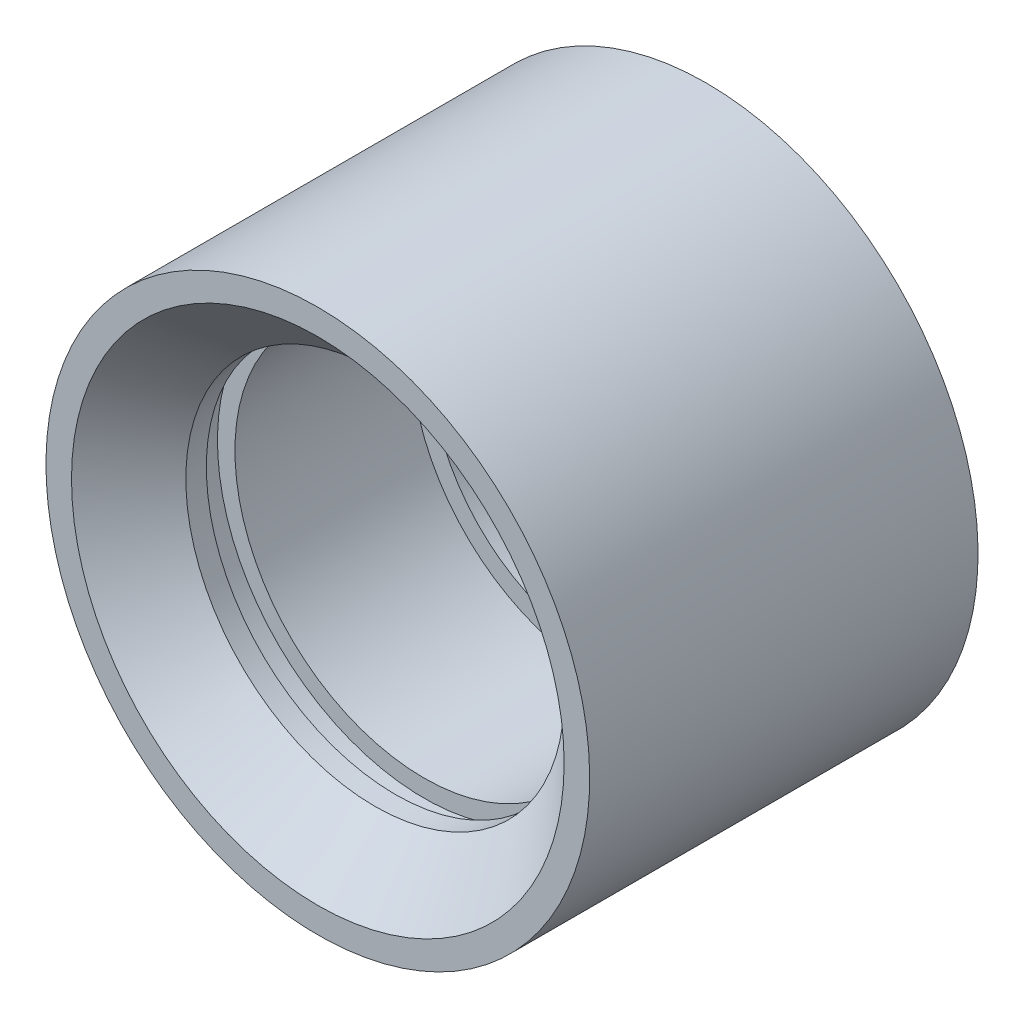
ISO-10303-21;
HEADER;
FILE_DESCRIPTION(('STEP AP214'),'2;1');
FILE_NAME('part.step','',(''),(''),'','','');
FILE_SCHEMA(('AUTOMOTIVE_DESIGN { 1 0 10303 214 1 1 1 1 }'));
ENDSEC;
DATA;
#1=APPLICATION_CONTEXT('core data for automotive mechanical design processes');
#2=APPLICATION_PROTOCOL_DEFINITION('international standard','automotive_design',2000,#1);
#3=PRODUCT_CONTEXT('',#1,'mechanical');
#4=PRODUCT('Part','Part','',(#3));
#5=PRODUCT_RELATED_PRODUCT_CATEGORY('part','',(#4));
#6=PRODUCT_DEFINITION_FORMATION('','',#4);
#7=PRODUCT_DEFINITION_CONTEXT('part definition',#1,'design');
#8=PRODUCT_DEFINITION('design','',#6,#7);
#9=PRODUCT_DEFINITION_SHAPE('','',#8);
#10=(LENGTH_UNIT() NAMED_UNIT(*) SI_UNIT(.MILLI.,.METRE.));
#11=(NAMED_UNIT(*) PLANE_ANGLE_UNIT() SI_UNIT($,.RADIAN.));
#12=(NAMED_UNIT(*) SI_UNIT($,.STERADIAN.) SOLID_ANGLE_UNIT());
#13=UNCERTAINTY_MEASURE_WITH_UNIT(LENGTH_MEASURE(1.E-05),#10,'distance_accuracy_value','');
#14=(GEOMETRIC_REPRESENTATION_CONTEXT(3) GLOBAL_UNCERTAINTY_ASSIGNED_CONTEXT((#13)) GLOBAL_UNIT_ASSIGNED_CONTEXT((#10,
#11,#12)) REPRESENTATION_CONTEXT('',''));
#15=CARTESIAN_POINT('',(0.,0.,0.));
#16=DIRECTION('',(0.,0.,1.));
#17=DIRECTION('',(1.,0.,0.));
#18=AXIS2_PLACEMENT_3D('',#15,#16,#17);
#19=CARTESIAN_POINT('',(0.,0.,-7.9375));
#20=DIRECTION('',(0.,0.,-1.));
#21=DIRECTION('',(0.,1.,0.));
#22=AXIS2_PLACEMENT_3D('',#19,#20,#21);
#23=CYLINDRICAL_SURFACE('',#22,7.73176);
#24=CARTESIAN_POINT('',(0.,0.,5.60070000000001));
#25=DIRECTION('',(0.,0.,-1.));
#26=DIRECTION('',(0.,1.,0.));
#27=AXIS2_PLACEMENT_3D('',#24,#25,#26);
#28=CIRCLE('',#27,7.73176);
#29=CARTESIAN_POINT('',(0.,7.73176,5.60070000000001));
#30=VERTEX_POINT('',#29);
#31=EDGE_CURVE('E10',#30,#30,#28,.T.);
#32=ORIENTED_EDGE('',*,*,#31,.F.);
#33=EDGE_LOOP('',(#32));
#34=FACE_BOUND('',#33,.T.);
#35=CARTESIAN_POINT('',(0.,0.,4.7625));
#36=DIRECTION('',(0.,0.,-1.));
#37=DIRECTION('',(0.,1.,0.));
#38=AXIS2_PLACEMENT_3D('',#35,#36,#37);
#39=CIRCLE('',#38,7.73176);
#40=CARTESIAN_POINT('',(0.,7.73176,4.7625));
#41=VERTEX_POINT('',#40);
#42=EDGE_CURVE('E78',#41,#41,#39,.T.);
#43=ORIENTED_EDGE('',*,*,#42,.T.);
#44=EDGE_LOOP('',(#43));
#45=FACE_BOUND('',#44,.T.);
#46=ADVANCED_FACE('F38',(#34,#45),#23,.F.);
#47=CARTESIAN_POINT('',(0.,0.,5.60070000000001));
#48=DIRECTION('',(0.,0.,1.));
#49=DIRECTION('',(0.,-1.,0.));
#50=AXIS2_PLACEMENT_3D('',#47,#48,#49);
#51=CONICAL_SURFACE('',#50,7.73176,0.785398163397449);
#52=CARTESIAN_POINT('',(0.,0.,7.9375));
#53=DIRECTION('',(0.,0.,-1.));
#54=DIRECTION('',(0.,1.,0.));
#55=AXIS2_PLACEMENT_3D('',#52,#53,#54);
#56=CIRCLE('',#55,10.06856);
#57=CARTESIAN_POINT('',(0.,10.06856,7.9375));
#58=VERTEX_POINT('',#57);
#59=EDGE_CURVE('E44',#58,#58,#56,.T.);
#60=ORIENTED_EDGE('',*,*,#59,.F.);
#61=EDGE_LOOP('',(#60));
#62=FACE_BOUND('',#61,.T.);
#63=ORIENTED_EDGE('',*,*,#31,.T.);
#64=EDGE_LOOP('',(#63));
#65=FACE_BOUND('',#64,.T.);
#66=ADVANCED_FACE('F95',(#62,#65),#51,.F.);
#67=CARTESIAN_POINT('',(0.,0.,7.9375));
#68=DIRECTION('',(0.,0.,1.));
#69=DIRECTION('',(0.,-1.,0.));
#70=AXIS2_PLACEMENT_3D('',#67,#68,#69);
#71=PLANE('',#70);
#72=ORIENTED_EDGE('',*,*,#59,.T.);
#73=EDGE_LOOP('',(#72));
#74=FACE_BOUND('',#73,.T.);
#75=CARTESIAN_POINT('',(0.,0.,7.9375));
#76=DIRECTION('',(0.,0.,-1.));
#77=DIRECTION('',(0.,1.,0.));
#78=AXIS2_PLACEMENT_3D('',#75,#76,#77);
#79=CIRCLE('',#78,11.1125);
#80=CARTESIAN_POINT('',(0.,11.1125,7.9375));
#81=VERTEX_POINT('',#80);
#82=EDGE_CURVE('E48',#81,#81,#79,.T.);
#83=ORIENTED_EDGE('',*,*,#82,.F.);
#84=EDGE_LOOP('',(#83));
#85=FACE_BOUND('',#84,.T.);
#86=ADVANCED_FACE('F100',(#74,#85),#71,.T.);
#87=CARTESIAN_POINT('',(0.,0.,-7.9375));
#88=DIRECTION('',(0.,0.,-1.));
#89=DIRECTION('',(0.,1.,0.));
#90=AXIS2_PLACEMENT_3D('',#87,#88,#89);
#91=CYLINDRICAL_SURFACE('',#90,11.1125);
#92=ORIENTED_EDGE('',*,*,#82,.T.);
#93=EDGE_LOOP('',(#92));
#94=FACE_BOUND('',#93,.T.);
#95=CARTESIAN_POINT('',(0.,0.,-7.9375));
#96=DIRECTION('',(0.,0.,-1.));
#97=DIRECTION('',(0.,1.,0.));
#98=AXIS2_PLACEMENT_3D('',#95,#96,#97);
#99=CIRCLE('',#98,11.1125);
#100=CARTESIAN_POINT('',(0.,11.1125,-7.9375));
#101=VERTEX_POINT('',#100);
#102=EDGE_CURVE('E52',#101,#101,#99,.T.);
#103=ORIENTED_EDGE('',*,*,#102,.F.);
#104=EDGE_LOOP('',(#103));
#105=FACE_BOUND('',#104,.T.);
#106=ADVANCED_FACE('F105',(#94,#105),#91,.T.);
#107=CARTESIAN_POINT('',(0.,0.,-7.9375));
#108=DIRECTION('',(0.,0.,-1.));
#109=DIRECTION('',(0.,1.,0.));
#110=AXIS2_PLACEMENT_3D('',#107,#108,#109);
#111=PLANE('',#110);
#112=ORIENTED_EDGE('',*,*,#102,.T.);
#113=EDGE_LOOP('',(#112));
#114=FACE_BOUND('',#113,.T.);
#115=CARTESIAN_POINT('',(0.,0.,-7.9375));
#116=DIRECTION('',(0.,0.,-1.));
#117=DIRECTION('',(0.,1.,0.));
#118=AXIS2_PLACEMENT_3D('',#115,#116,#117);
#119=CIRCLE('',#118,10.06856);
#120=CARTESIAN_POINT('',(0.,10.06856,-7.9375));
#121=VERTEX_POINT('',#120);
#122=EDGE_CURVE('E57',#121,#121,#119,.T.);
#123=ORIENTED_EDGE('',*,*,#122,.F.);
#124=EDGE_LOOP('',(#123));
#125=FACE_BOUND('',#124,.T.);
#126=ADVANCED_FACE('F110',(#114,#125),#111,.T.);
#127=CARTESIAN_POINT('',(0.,0.,-4.81457000000003));
#128=DIRECTION('',(0.,0.,-1.));
#129=DIRECTION('',(0.,1.,0.));
#130=AXIS2_PLACEMENT_3D('',#127,#128,#129);
#131=CONICAL_SURFACE('',#130,6.94562999999999,0.785398163397453);
#132=ORIENTED_EDGE('',*,*,#122,.T.);
#133=EDGE_LOOP('',(#132));
#134=FACE_BOUND('',#133,.T.);
#135=CARTESIAN_POINT('',(0.,0.,-4.81457000000003));
#136=DIRECTION('',(0.,0.,-1.));
#137=DIRECTION('',(0.,1.,0.));
#138=AXIS2_PLACEMENT_3D('',#135,#136,#137);
#139=CIRCLE('',#138,6.94562999999999);
#140=CARTESIAN_POINT('',(0.,6.94562999999999,-4.81457000000003));
#141=VERTEX_POINT('',#140);
#142=EDGE_CURVE('E60',#141,#141,#139,.T.);
#143=ORIENTED_EDGE('',*,*,#142,.F.);
#144=EDGE_LOOP('',(#143));
#145=FACE_BOUND('',#144,.T.);
#146=ADVANCED_FACE('F114',(#134,#145),#131,.F.);
#147=CARTESIAN_POINT('',(0.,0.,-7.9375));
#148=DIRECTION('',(0.,0.,-1.));
#149=DIRECTION('',(0.,1.,0.));
#150=AXIS2_PLACEMENT_3D('',#147,#148,#149);
#151=CYLINDRICAL_SURFACE('',#150,6.94562999999999);
#152=ORIENTED_EDGE('',*,*,#142,.T.);
#153=EDGE_LOOP('',(#152));
#154=FACE_BOUND('',#153,.T.);
#155=CARTESIAN_POINT('',(0.,0.,-3.5941));
#156=DIRECTION('',(0.,0.,-1.));
#157=DIRECTION('',(0.,1.,0.));
#158=AXIS2_PLACEMENT_3D('',#155,#156,#157);
#159=CIRCLE('',#158,6.94562999999999);
#160=CARTESIAN_POINT('',(0.,6.94562999999999,-3.5941));
#161=VERTEX_POINT('',#160);
#162=EDGE_CURVE('E63',#161,#161,#159,.T.);
#163=ORIENTED_EDGE('',*,*,#162,.F.);
#164=EDGE_LOOP('',(#163));
#165=FACE_BOUND('',#164,.T.);
#166=ADVANCED_FACE('F118',(#154,#165),#151,.F.);
#167=CARTESIAN_POINT('',(0.,0.,-3.5941));
#168=DIRECTION('',(0.,0.,1.));
#169=DIRECTION('',(0.,-1.,0.));
#170=AXIS2_PLACEMENT_3D('',#167,#168,#169);
#171=PLANE('',#170);
#172=ORIENTED_EDGE('',*,*,#162,.T.);
#173=EDGE_LOOP('',(#172));
#174=FACE_BOUND('',#173,.T.);
#175=CARTESIAN_POINT('',(0.,0.,-3.5941));
#176=DIRECTION('',(0.,0.,-1.));
#177=DIRECTION('',(0.,1.,0.));
#178=AXIS2_PLACEMENT_3D('',#175,#176,#177);
#179=CIRCLE('',#178,7.73176);
#180=CARTESIAN_POINT('',(0.,7.73176,-3.5941));
#181=VERTEX_POINT('',#180);
#182=EDGE_CURVE('E66',#181,#181,#179,.T.);
#183=ORIENTED_EDGE('',*,*,#182,.F.);
#184=EDGE_LOOP('',(#183));
#185=FACE_BOUND('',#184,.T.);
#186=ADVANCED_FACE('F122',(#174,#185),#171,.T.);
#187=CARTESIAN_POINT('',(0.,0.,-7.9375));
#188=DIRECTION('',(0.,0.,-1.));
#189=DIRECTION('',(0.,1.,0.));
#190=AXIS2_PLACEMENT_3D('',#187,#188,#189);
#191=CYLINDRICAL_SURFACE('',#190,7.73176);
#192=ORIENTED_EDGE('',*,*,#182,.T.);
#193=EDGE_LOOP('',(#192));
#194=FACE_BOUND('',#193,.T.);
#195=CARTESIAN_POINT('',(0.,0.,3.5941));
#196=DIRECTION('',(0.,0.,-1.));
#197=DIRECTION('',(0.,1.,0.));
#198=AXIS2_PLACEMENT_3D('',#195,#196,#197);
#199=CIRCLE('',#198,7.73176);
#200=CARTESIAN_POINT('',(0.,7.73176,3.5941));
#201=VERTEX_POINT('',#200);
#202=EDGE_CURVE('E69',#201,#201,#199,.T.);
#203=ORIENTED_EDGE('',*,*,#202,.F.);
#204=EDGE_LOOP('',(#203));
#205=FACE_BOUND('',#204,.T.);
#206=ADVANCED_FACE('F126',(#194,#205),#191,.F.);
#207=CARTESIAN_POINT('',(0.,0.,3.5941));
#208=DIRECTION('',(0.,0.,1.));
#209=DIRECTION('',(0.,-1.,0.));
#210=AXIS2_PLACEMENT_3D('',#207,#208,#209);
#211=PLANE('',#210);
#212=ORIENTED_EDGE('',*,*,#202,.T.);
#213=EDGE_LOOP('',(#212));
#214=FACE_BOUND('',#213,.T.);
#215=CARTESIAN_POINT('',(0.,0.,3.5941));
#216=DIRECTION('',(0.,0.,-1.));
#217=DIRECTION('',(0.,1.,0.));
#218=AXIS2_PLACEMENT_3D('',#215,#216,#217);
#219=CIRCLE('',#218,8.4455);
#220=CARTESIAN_POINT('',(0.,8.4455,3.5941));
#221=VERTEX_POINT('',#220);
#222=EDGE_CURVE('E72',#221,#221,#219,.T.);
#223=ORIENTED_EDGE('',*,*,#222,.F.);
#224=EDGE_LOOP('',(#223));
#225=FACE_BOUND('',#224,.T.);
#226=ADVANCED_FACE('F91',(#214,#225),#211,.T.);
#227=CARTESIAN_POINT('',(0.,0.,-7.9375));
#228=DIRECTION('',(0.,0.,-1.));
#229=DIRECTION('',(0.,1.,0.));
#230=AXIS2_PLACEMENT_3D('',#227,#228,#229);
#231=CYLINDRICAL_SURFACE('',#230,8.4455);
#232=ORIENTED_EDGE('',*,*,#222,.T.);
#233=EDGE_LOOP('',(#232));
#234=FACE_BOUND('',#233,.T.);
#235=CARTESIAN_POINT('',(0.,0.,4.7625));
#236=DIRECTION('',(0.,0.,-1.));
#237=DIRECTION('',(0.,1.,0.));
#238=AXIS2_PLACEMENT_3D('',#235,#236,#237);
#239=CIRCLE('',#238,8.4455);
#240=CARTESIAN_POINT('',(0.,8.4455,4.7625));
#241=VERTEX_POINT('',#240);
#242=EDGE_CURVE('E75',#241,#241,#239,.T.);
#243=ORIENTED_EDGE('',*,*,#242,.F.);
#244=EDGE_LOOP('',(#243));
#245=FACE_BOUND('',#244,.T.);
#246=ADVANCED_FACE('F85',(#234,#245),#231,.F.);
#247=CARTESIAN_POINT('',(0.,0.,4.7625));
#248=DIRECTION('',(0.,0.,-1.));
#249=DIRECTION('',(0.,1.,0.));
#250=AXIS2_PLACEMENT_3D('',#247,#248,#249);
#251=PLANE('',#250);
#252=ORIENTED_EDGE('',*,*,#242,.T.);
#253=EDGE_LOOP('',(#252));
#254=FACE_BOUND('',#253,.T.);
#255=ORIENTED_EDGE('',*,*,#42,.F.);
#256=EDGE_LOOP('',(#255));
#257=FACE_BOUND('',#256,.T.);
#258=ADVANCED_FACE('F83',(#254,#257),#251,.T.);
#259=CLOSED_SHELL('',(#46,#66,#86,#106,#126,#146,#166,#186,#206,#226,#246,#258));
#260=MANIFOLD_SOLID_BREP('B2',#259);
#261=ADVANCED_BREP_SHAPE_REPRESENTATION('',(#18,#260),#14);
#262=SHAPE_DEFINITION_REPRESENTATION(#9,#261);
ENDSEC;
END-ISO-10303-21;
